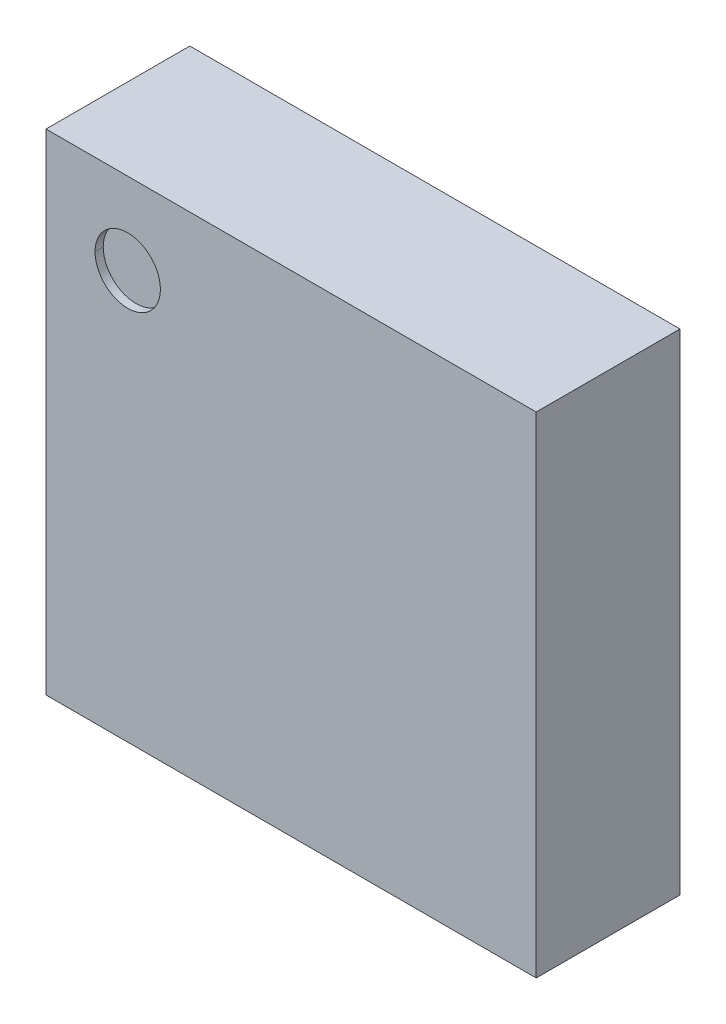
ISO-10303-21;
HEADER;
FILE_DESCRIPTION(('STEP AP214'),'2;1');
FILE_NAME('part.step','',(''),(''),'','','');
FILE_SCHEMA(('AUTOMOTIVE_DESIGN { 1 0 10303 214 1 1 1 1 }'));
ENDSEC;
DATA;
#1=APPLICATION_CONTEXT('core data for automotive mechanical design processes');
#2=APPLICATION_PROTOCOL_DEFINITION('international standard','automotive_design',2000,#1);
#3=PRODUCT_CONTEXT('',#1,'mechanical');
#4=PRODUCT('Part','Part','',(#3));
#5=PRODUCT_RELATED_PRODUCT_CATEGORY('part','',(#4));
#6=PRODUCT_DEFINITION_FORMATION('','',#4);
#7=PRODUCT_DEFINITION_CONTEXT('part definition',#1,'design');
#8=PRODUCT_DEFINITION('design','',#6,#7);
#9=PRODUCT_DEFINITION_SHAPE('','',#8);
#10=(LENGTH_UNIT() NAMED_UNIT(*) SI_UNIT(.MILLI.,.METRE.));
#11=(NAMED_UNIT(*) PLANE_ANGLE_UNIT() SI_UNIT($,.RADIAN.));
#12=(NAMED_UNIT(*) SI_UNIT($,.STERADIAN.) SOLID_ANGLE_UNIT());
#13=UNCERTAINTY_MEASURE_WITH_UNIT(LENGTH_MEASURE(1.E-05),#10,'distance_accuracy_value','');
#14=(GEOMETRIC_REPRESENTATION_CONTEXT(3) GLOBAL_UNCERTAINTY_ASSIGNED_CONTEXT((#13)) GLOBAL_UNIT_ASSIGNED_CONTEXT((#10,
#11,#12)) REPRESENTATION_CONTEXT('',''));
#15=CARTESIAN_POINT('',(0.,0.,0.));
#16=DIRECTION('',(0.,0.,1.));
#17=DIRECTION('',(1.,0.,0.));
#18=AXIS2_PLACEMENT_3D('',#15,#16,#17);
#19=CARTESIAN_POINT('',(-1.02832069959543,1.,0.85));
#20=DIRECTION('',(0.,0.,1.));
#21=DIRECTION('',(1.,0.,0.));
#22=AXIS2_PLACEMENT_3D('',#19,#20,#21);
#23=PLANE('',#22);
#24=CARTESIAN_POINT('',(-1.02832069959543,1.,0.85));
#25=DIRECTION('',(0.,0.,1.));
#26=DIRECTION('',(-1.,0.,0.));
#27=AXIS2_PLACEMENT_3D('',#24,#25,#26);
#28=CIRCLE('',#27,0.2);
#29=CARTESIAN_POINT('',(-1.22832069959544,1.,0.85));
#30=VERTEX_POINT('',#29);
#31=CARTESIAN_POINT('',(-0.828320699595435,1.,0.85));
#32=VERTEX_POINT('',#31);
#33=EDGE_CURVE('E105',#30,#32,#28,.T.);
#34=ORIENTED_EDGE('',*,*,#33,.T.);
#35=CARTESIAN_POINT('',(-1.02832069959543,1.,0.85));
#36=DIRECTION('',(0.,0.,1.));
#37=DIRECTION('',(-1.,0.,0.));
#38=AXIS2_PLACEMENT_3D('',#35,#36,#37);
#39=CIRCLE('',#38,0.2);
#40=EDGE_CURVE('E11',#32,#30,#39,.T.);
#41=ORIENTED_EDGE('',*,*,#40,.T.);
#42=EDGE_LOOP('',(#34,#41));
#43=FACE_BOUND('',#42,.T.);
#44=ADVANCED_FACE('F16',(#43),#23,.T.);
#45=CARTESIAN_POINT('',(-1.02832069959543,1.,0.85));
#46=DIRECTION('',(0.,0.,-1.));
#47=DIRECTION('',(-1.,0.,0.));
#48=AXIS2_PLACEMENT_3D('',#45,#46,#47);
#49=CYLINDRICAL_SURFACE('',#48,0.2);
#50=DIRECTION('',(0.,0.,-1.));
#51=VECTOR('',#50,1.);
#52=CARTESIAN_POINT('',(-0.828320699595435,1.,0.85));
#53=LINE('',#52,#51);
#54=CARTESIAN_POINT('',(-0.828320699595435,1.,0.9));
#55=VERTEX_POINT('',#54);
#56=EDGE_CURVE('E100',#55,#32,#53,.T.);
#57=ORIENTED_EDGE('',*,*,#56,.F.);
#58=CARTESIAN_POINT('',(-1.02832069959543,1.,0.9));
#59=DIRECTION('',(0.,0.,-1.));
#60=DIRECTION('',(-1.,0.,0.));
#61=AXIS2_PLACEMENT_3D('',#58,#59,#60);
#62=CIRCLE('',#61,0.2);
#63=CARTESIAN_POINT('',(-1.22832069959544,1.,0.9));
#64=VERTEX_POINT('',#63);
#65=EDGE_CURVE('E26',#64,#55,#62,.T.);
#66=ORIENTED_EDGE('',*,*,#65,.F.);
#67=DIRECTION('',(0.,0.,-1.));
#68=VECTOR('',#67,1.);
#69=CARTESIAN_POINT('',(-1.22832069959544,1.,0.85));
#70=LINE('',#69,#68);
#71=EDGE_CURVE('E103',#64,#30,#70,.T.);
#72=ORIENTED_EDGE('',*,*,#71,.T.);
#73=ORIENTED_EDGE('',*,*,#40,.F.);
#74=EDGE_LOOP('',(#57,#66,#72,#73));
#75=FACE_BOUND('',#74,.T.);
#76=ADVANCED_FACE('F98',(#75),#49,.F.);
#77=CARTESIAN_POINT('',(1.47167930040457,-1.5,0.9));
#78=DIRECTION('',(0.,0.,1.));
#79=DIRECTION('',(1.,0.,0.));
#80=AXIS2_PLACEMENT_3D('',#77,#78,#79);
#81=PLANE('',#80);
#82=ORIENTED_EDGE('',*,*,#65,.T.);
#83=CARTESIAN_POINT('',(-1.02832069959543,1.,0.9));
#84=DIRECTION('',(0.,0.,-1.));
#85=DIRECTION('',(-1.,0.,0.));
#86=AXIS2_PLACEMENT_3D('',#83,#84,#85);
#87=CIRCLE('',#86,0.2);
#88=EDGE_CURVE('E111',#55,#64,#87,.T.);
#89=ORIENTED_EDGE('',*,*,#88,.T.);
#90=EDGE_LOOP('',(#82,#89));
#91=FACE_BOUND('',#90,.T.);
#92=DIRECTION('',(1.,0.,0.));
#93=VECTOR('',#92,1.);
#94=CARTESIAN_POINT('',(-0.028320699595436,-1.5,0.9));
#95=LINE('',#94,#93);
#96=CARTESIAN_POINT('',(-1.52832069959544,-1.5,0.9));
#97=VERTEX_POINT('',#96);
#98=CARTESIAN_POINT('',(1.47167930040456,-1.5,0.9));
#99=VERTEX_POINT('',#98);
#100=EDGE_CURVE('E129',#97,#99,#95,.T.);
#101=ORIENTED_EDGE('',*,*,#100,.T.);
#102=DIRECTION('',(0.,1.,0.));
#103=VECTOR('',#102,1.);
#104=CARTESIAN_POINT('',(1.47167930040456,0.,0.9));
#105=LINE('',#104,#103);
#106=CARTESIAN_POINT('',(1.47167930040456,1.5,0.9));
#107=VERTEX_POINT('',#106);
#108=EDGE_CURVE('E130',#99,#107,#105,.T.);
#109=ORIENTED_EDGE('',*,*,#108,.T.);
#110=DIRECTION('',(1.,0.,0.));
#111=VECTOR('',#110,1.);
#112=CARTESIAN_POINT('',(-0.0283206995954357,1.5,0.9));
#113=LINE('',#112,#111);
#114=CARTESIAN_POINT('',(-1.52832069959544,1.5,0.9));
#115=VERTEX_POINT('',#114);
#116=EDGE_CURVE('E40',#115,#107,#113,.T.);
#117=ORIENTED_EDGE('',*,*,#116,.F.);
#118=DIRECTION('',(0.,1.,0.));
#119=VECTOR('',#118,1.);
#120=CARTESIAN_POINT('',(-1.52832069959544,0.,0.9));
#121=LINE('',#120,#119);
#122=EDGE_CURVE('E157',#97,#115,#121,.T.);
#123=ORIENTED_EDGE('',*,*,#122,.F.);
#124=EDGE_LOOP('',(#101,#109,#117,#123));
#125=FACE_BOUND('',#124,.T.);
#126=ADVANCED_FACE('F164',(#91,#125),#81,.T.);
#127=CARTESIAN_POINT('',(-0.0283206995954357,1.5,0.238538731150911));
#128=DIRECTION('',(0.,1.,0.));
#129=DIRECTION('',(0.,0.,-1.));
#130=AXIS2_PLACEMENT_3D('',#127,#128,#129);
#131=PLANE('',#130);
#132=DIRECTION('',(0.,0.,-1.));
#133=VECTOR('',#132,1.);
#134=CARTESIAN_POINT('',(1.47167930040456,1.5,0.238538731150911));
#135=LINE('',#134,#133);
#136=CARTESIAN_POINT('',(1.47167930040456,1.5,0.02));
#137=VERTEX_POINT('',#136);
#138=EDGE_CURVE('E58',#107,#137,#135,.T.);
#139=ORIENTED_EDGE('',*,*,#138,.T.);
#140=DIRECTION('',(-1.,0.,0.));
#141=VECTOR('',#140,1.);
#142=CARTESIAN_POINT('',(-0.028320699595436,1.5,0.02));
#143=LINE('',#142,#141);
#144=CARTESIAN_POINT('',(-1.52832069959544,1.5,0.02));
#145=VERTEX_POINT('',#144);
#146=EDGE_CURVE('E131',#137,#145,#143,.T.);
#147=ORIENTED_EDGE('',*,*,#146,.T.);
#148=DIRECTION('',(0.,0.,-1.));
#149=VECTOR('',#148,1.);
#150=CARTESIAN_POINT('',(-1.52832069959544,1.5,0.238538731150911));
#151=LINE('',#150,#149);
#152=EDGE_CURVE('E72',#115,#145,#151,.T.);
#153=ORIENTED_EDGE('',*,*,#152,.F.);
#154=ORIENTED_EDGE('',*,*,#116,.T.);
#155=EDGE_LOOP('',(#139,#147,#153,#154));
#156=FACE_BOUND('',#155,.T.);
#157=ADVANCED_FACE('F321',(#156),#131,.T.);
#158=CARTESIAN_POINT('',(-1.52832069959544,0.,0.238538731150911));
#159=DIRECTION('',(-1.,0.,0.));
#160=DIRECTION('',(0.,0.,1.));
#161=AXIS2_PLACEMENT_3D('',#158,#159,#160);
#162=PLANE('',#161);
#163=ORIENTED_EDGE('',*,*,#152,.T.);
#164=DIRECTION('',(0.,-1.,0.));
#165=VECTOR('',#164,1.);
#166=CARTESIAN_POINT('',(-1.52832069959544,0.,0.02));
#167=LINE('',#166,#165);
#168=CARTESIAN_POINT('',(-1.52832069959544,-1.5,0.02));
#169=VERTEX_POINT('',#168);
#170=EDGE_CURVE('E125',#145,#169,#167,.T.);
#171=ORIENTED_EDGE('',*,*,#170,.T.);
#172=DIRECTION('',(0.,0.,1.));
#173=VECTOR('',#172,1.);
#174=CARTESIAN_POINT('',(-1.52832069959544,-1.5,0.238538731150911));
#175=LINE('',#174,#173);
#176=EDGE_CURVE('E151',#169,#97,#175,.T.);
#177=ORIENTED_EDGE('',*,*,#176,.T.);
#178=ORIENTED_EDGE('',*,*,#122,.T.);
#179=EDGE_LOOP('',(#163,#171,#177,#178));
#180=FACE_BOUND('',#179,.T.);
#181=ADVANCED_FACE('F294',(#180),#162,.T.);
#182=CARTESIAN_POINT('',(-0.028320699595436,-1.5,0.238538731150911));
#183=DIRECTION('',(0.,1.,0.));
#184=DIRECTION('',(0.,0.,-1.));
#185=AXIS2_PLACEMENT_3D('',#182,#183,#184);
#186=PLANE('',#185);
#187=DIRECTION('',(0.,0.,1.));
#188=VECTOR('',#187,1.);
#189=CARTESIAN_POINT('',(1.47167930040456,-1.5,0.238538731150911));
#190=LINE('',#189,#188);
#191=CARTESIAN_POINT('',(1.47167930040456,-1.5,0.02));
#192=VERTEX_POINT('',#191);
#193=EDGE_CURVE('E126',#192,#99,#190,.T.);
#194=ORIENTED_EDGE('',*,*,#193,.T.);
#195=ORIENTED_EDGE('',*,*,#100,.F.);
#196=ORIENTED_EDGE('',*,*,#176,.F.);
#197=DIRECTION('',(1.,0.,0.));
#198=VECTOR('',#197,1.);
#199=CARTESIAN_POINT('',(-0.028320699595436,-1.5,0.02));
#200=LINE('',#199,#198);
#201=EDGE_CURVE('E122',#169,#192,#200,.T.);
#202=ORIENTED_EDGE('',*,*,#201,.T.);
#203=EDGE_LOOP('',(#194,#195,#196,#202));
#204=FACE_BOUND('',#203,.T.);
#205=ADVANCED_FACE('F18',(#204),#186,.F.);
#206=CARTESIAN_POINT('',(1.47167930040456,0.,0.238538731150911));
#207=DIRECTION('',(-1.,0.,0.));
#208=DIRECTION('',(0.,0.,1.));
#209=AXIS2_PLACEMENT_3D('',#206,#207,#208);
#210=PLANE('',#209);
#211=ORIENTED_EDGE('',*,*,#138,.F.);
#212=ORIENTED_EDGE('',*,*,#108,.F.);
#213=ORIENTED_EDGE('',*,*,#193,.F.);
#214=DIRECTION('',(0.,1.,0.));
#215=VECTOR('',#214,1.);
#216=CARTESIAN_POINT('',(1.47167930040456,0.,0.02));
#217=LINE('',#216,#215);
#218=EDGE_CURVE('E133',#192,#137,#217,.T.);
#219=ORIENTED_EDGE('',*,*,#218,.T.);
#220=EDGE_LOOP('',(#211,#212,#213,#219));
#221=FACE_BOUND('',#220,.T.);
#222=ADVANCED_FACE('F169',(#221),#210,.F.);
#223=CARTESIAN_POINT('',(-0.028320699595436,0.,0.02));
#224=DIRECTION('',(0.,0.,1.));
#225=DIRECTION('',(0.,-1.,0.));
#226=AXIS2_PLACEMENT_3D('',#223,#224,#225);
#227=PLANE('',#226);
#228=ORIENTED_EDGE('',*,*,#201,.F.);
#229=ORIENTED_EDGE('',*,*,#170,.F.);
#230=ORIENTED_EDGE('',*,*,#146,.F.);
#231=ORIENTED_EDGE('',*,*,#218,.F.);
#232=EDGE_LOOP('',(#228,#229,#230,#231));
#233=FACE_BOUND('',#232,.T.);
#234=ADVANCED_FACE('F313',(#233),#227,.F.);
#235=CARTESIAN_POINT('',(-1.02832069959543,1.,0.85));
#236=DIRECTION('',(0.,0.,-1.));
#237=DIRECTION('',(-1.,0.,0.));
#238=AXIS2_PLACEMENT_3D('',#235,#236,#237);
#239=CYLINDRICAL_SURFACE('',#238,0.2);
#240=ORIENTED_EDGE('',*,*,#88,.F.);
#241=ORIENTED_EDGE('',*,*,#56,.T.);
#242=ORIENTED_EDGE('',*,*,#33,.F.);
#243=ORIENTED_EDGE('',*,*,#71,.F.);
#244=EDGE_LOOP('',(#240,#241,#242,#243));
#245=FACE_BOUND('',#244,.T.);
#246=ADVANCED_FACE('F109',(#245),#239,.F.);
#247=CLOSED_SHELL('',(#44,#76,#126,#157,#181,#205,#222,#234,#246));
#248=MANIFOLD_SOLID_BREP('B1',#247);
#249=ADVANCED_BREP_SHAPE_REPRESENTATION('',(#18,#248),#14);
#250=SHAPE_DEFINITION_REPRESENTATION(#9,#249);
ENDSEC;
END-ISO-10303-21;
